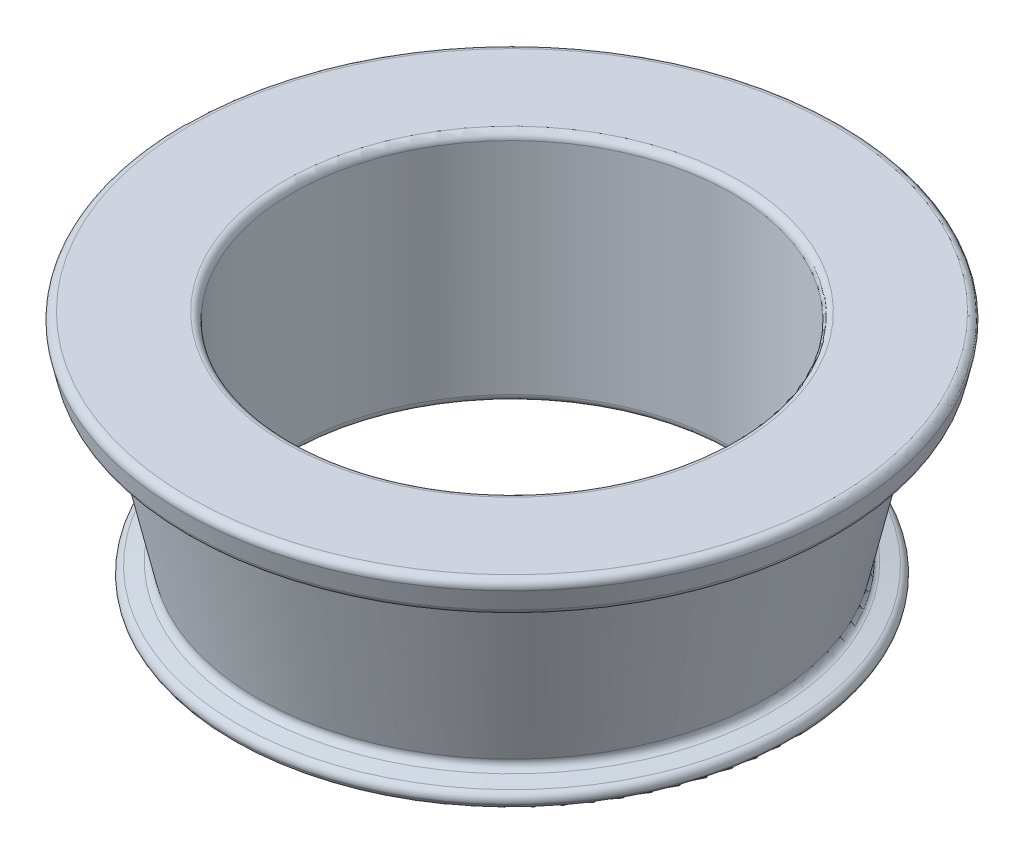
ISO-10303-21;
HEADER;
FILE_DESCRIPTION(('STEP AP214'),'2;1');
FILE_NAME('part.step','',(''),(''),'','','');
FILE_SCHEMA(('AUTOMOTIVE_DESIGN { 1 0 10303 214 1 1 1 1 }'));
ENDSEC;
DATA;
#1=APPLICATION_CONTEXT('core data for automotive mechanical design processes');
#2=APPLICATION_PROTOCOL_DEFINITION('international standard','automotive_design',2000,#1);
#3=PRODUCT_CONTEXT('',#1,'mechanical');
#4=PRODUCT('Part','Part','',(#3));
#5=PRODUCT_RELATED_PRODUCT_CATEGORY('part','',(#4));
#6=PRODUCT_DEFINITION_FORMATION('','',#4);
#7=PRODUCT_DEFINITION_CONTEXT('part definition',#1,'design');
#8=PRODUCT_DEFINITION('design','',#6,#7);
#9=PRODUCT_DEFINITION_SHAPE('','',#8);
#10=(LENGTH_UNIT() NAMED_UNIT(*) SI_UNIT(.MILLI.,.METRE.));
#11=(NAMED_UNIT(*) PLANE_ANGLE_UNIT() SI_UNIT($,.RADIAN.));
#12=(NAMED_UNIT(*) SI_UNIT($,.STERADIAN.) SOLID_ANGLE_UNIT());
#13=UNCERTAINTY_MEASURE_WITH_UNIT(LENGTH_MEASURE(1.E-05),#10,'distance_accuracy_value','');
#14=(GEOMETRIC_REPRESENTATION_CONTEXT(3) GLOBAL_UNCERTAINTY_ASSIGNED_CONTEXT((#13)) GLOBAL_UNIT_ASSIGNED_CONTEXT((#10,
#11,#12)) REPRESENTATION_CONTEXT('',''));
#15=CARTESIAN_POINT('',(0.,0.,0.));
#16=DIRECTION('',(0.,0.,1.));
#17=DIRECTION('',(1.,0.,0.));
#18=AXIS2_PLACEMENT_3D('',#15,#16,#17);
#19=CARTESIAN_POINT('',(0.,0.900000000000007,0.));
#20=DIRECTION('',(0.,1.,0.));
#21=DIRECTION('',(0.,0.,1.));
#22=AXIS2_PLACEMENT_3D('',#19,#20,#21);
#23=CONICAL_SURFACE('',#22,19.248483998542,0.269382388297483);
#24=CARTESIAN_POINT('',(0.,0.366931925164515,0.));
#25=DIRECTION('',(0.,-1.,0.));
#26=DIRECTION('',(0.,0.,-1.));
#27=AXIS2_PLACEMENT_3D('',#24,#25,#26);
#28=CIRCLE('',#27,19.1013074577307);
#29=CARTESIAN_POINT('',(0.,0.366931925164515,-19.1013074577307));
#30=VERTEX_POINT('',#29);
#31=EDGE_CURVE('E85',#30,#30,#28,.F.);
#32=ORIENTED_EDGE('',*,*,#31,.T.);
#33=EDGE_LOOP('',(#32));
#34=FACE_BOUND('',#33,.T.);
#35=CARTESIAN_POINT('',(0.,0.394463191682515,0.));
#36=DIRECTION('',(0.,-1.,0.));
#37=DIRECTION('',(0.,0.,-1.));
#38=AXIS2_PLACEMENT_3D('',#35,#36,#37);
#39=CIRCLE('',#38,19.1089086568299);
#40=CARTESIAN_POINT('',(0.,0.394463191682515,-19.1089086568299));
#41=VERTEX_POINT('',#40);
#42=EDGE_CURVE('E89',#41,#41,#39,.T.);
#43=ORIENTED_EDGE('',*,*,#42,.T.);
#44=EDGE_LOOP('',(#43));
#45=FACE_BOUND('',#44,.T.);
#46=ADVANCED_FACE('F41',(#34,#45),#23,.T.);
#47=CARTESIAN_POINT('',(-19.,0.,0.));
#48=DIRECTION('',(0.,1.,0.));
#49=DIRECTION('',(0.,0.,1.));
#50=AXIS2_PLACEMENT_3D('',#47,#48,#49);
#51=PLANE('',#50);
#52=CARTESIAN_POINT('',(0.,0.,0.));
#53=DIRECTION('',(0.,1.,0.));
#54=DIRECTION('',(0.,0.,1.));
#55=AXIS2_PLACEMENT_3D('',#52,#53,#54);
#56=CIRCLE('',#55,18.6193397332308);
#57=CARTESIAN_POINT('',(0.,0.,18.6193397332308));
#58=VERTEX_POINT('',#57);
#59=EDGE_CURVE('E93',#58,#58,#56,.F.);
#60=ORIENTED_EDGE('',*,*,#59,.T.);
#61=EDGE_LOOP('',(#60));
#62=FACE_BOUND('',#61,.T.);
#63=CARTESIAN_POINT('',(0.,0.,0.));
#64=DIRECTION('',(0.,1.,0.));
#65=DIRECTION('',(0.,0.,1.));
#66=AXIS2_PLACEMENT_3D('',#63,#64,#65);
#67=CIRCLE('',#66,15.5);
#68=CARTESIAN_POINT('',(0.,0.,15.5));
#69=VERTEX_POINT('',#68);
#70=EDGE_CURVE('E101',#69,#69,#67,.T.);
#71=ORIENTED_EDGE('',*,*,#70,.T.);
#72=EDGE_LOOP('',(#71));
#73=FACE_BOUND('',#72,.T.);
#74=ADVANCED_FACE('F136',(#62,#73),#51,.F.);
#75=CARTESIAN_POINT('',(0.,0.,0.));
#76=DIRECTION('',(0.,-1.,0.));
#77=DIRECTION('',(0.,0.,-1.));
#78=AXIS2_PLACEMENT_3D('',#75,#76,#77);
#79=CYLINDRICAL_SURFACE('',#78,15.);
#80=CARTESIAN_POINT('',(0.,0.499999999999998,0.));
#81=DIRECTION('',(0.,1.,0.));
#82=DIRECTION('',(0.,0.,1.));
#83=AXIS2_PLACEMENT_3D('',#80,#81,#82);
#84=CIRCLE('',#83,15.);
#85=CARTESIAN_POINT('',(0.,0.499999999999998,15.));
#86=VERTEX_POINT('',#85);
#87=EDGE_CURVE('E105',#86,#86,#84,.F.);
#88=ORIENTED_EDGE('',*,*,#87,.T.);
#89=EDGE_LOOP('',(#88));
#90=FACE_BOUND('',#89,.T.);
#91=CARTESIAN_POINT('',(0.,15.5,0.));
#92=DIRECTION('',(0.,-1.,0.));
#93=DIRECTION('',(0.,0.,-1.));
#94=AXIS2_PLACEMENT_3D('',#91,#92,#93);
#95=CIRCLE('',#94,15.);
#96=CARTESIAN_POINT('',(0.,15.5,-15.));
#97=VERTEX_POINT('',#96);
#98=EDGE_CURVE('E109',#97,#97,#95,.F.);
#99=ORIENTED_EDGE('',*,*,#98,.T.);
#100=EDGE_LOOP('',(#99));
#101=FACE_BOUND('',#100,.T.);
#102=ADVANCED_FACE('F114',(#90,#101),#79,.F.);
#103=CARTESIAN_POINT('',(-15.,16.,0.));
#104=DIRECTION('',(0.,-1.,0.));
#105=DIRECTION('',(0.,0.,-1.));
#106=AXIS2_PLACEMENT_3D('',#103,#104,#105);
#107=PLANE('',#106);
#108=CARTESIAN_POINT('',(0.,16.,0.));
#109=DIRECTION('',(0.,-1.,0.));
#110=DIRECTION('',(0.,0.,-1.));
#111=AXIS2_PLACEMENT_3D('',#108,#109,#110);
#112=CIRCLE('',#111,21.974780620572);
#113=CARTESIAN_POINT('',(0.,16.,-21.974780620572));
#114=VERTEX_POINT('',#113);
#115=EDGE_CURVE('E73',#114,#114,#112,.F.);
#116=ORIENTED_EDGE('',*,*,#115,.T.);
#117=EDGE_LOOP('',(#116));
#118=FACE_BOUND('',#117,.T.);
#119=CARTESIAN_POINT('',(0.,16.,0.));
#120=DIRECTION('',(0.,-1.,0.));
#121=DIRECTION('',(0.,0.,-1.));
#122=AXIS2_PLACEMENT_3D('',#119,#120,#121);
#123=CIRCLE('',#122,15.5);
#124=CARTESIAN_POINT('',(0.,16.,-15.5));
#125=VERTEX_POINT('',#124);
#126=EDGE_CURVE('E97',#125,#125,#123,.T.);
#127=ORIENTED_EDGE('',*,*,#126,.T.);
#128=EDGE_LOOP('',(#127));
#129=FACE_BOUND('',#128,.T.);
#130=ADVANCED_FACE('F124',(#118,#129),#107,.F.);
#131=CARTESIAN_POINT('',(0.,16.,0.));
#132=DIRECTION('',(0.,1.,0.));
#133=DIRECTION('',(0.,0.,1.));
#134=AXIS2_PLACEMENT_3D('',#131,#132,#133);
#135=CONICAL_SURFACE('',#134,22.6,0.221656815003283);
#136=CARTESIAN_POINT('',(0.,15.3900768978236,0.));
#137=DIRECTION('',(0.,-1.,0.));
#138=DIRECTION('',(0.,0.,-1.));
#139=AXIS2_PLACEMENT_3D('',#136,#137,#138);
#140=CIRCLE('',#139,22.4625478925449);
#141=CARTESIAN_POINT('',(0.,15.3900768978236,-22.4625478925449));
#142=VERTEX_POINT('',#141);
#143=EDGE_CURVE('E77',#142,#142,#140,.T.);
#144=ORIENTED_EDGE('',*,*,#143,.T.);
#145=EDGE_LOOP('',(#144));
#146=FACE_BOUND('',#145,.T.);
#147=CARTESIAN_POINT('',(0.,14.0489309121083,0.));
#148=DIRECTION('',(0.,-1.,0.));
#149=DIRECTION('',(0.,0.,-1.));
#150=AXIS2_PLACEMENT_3D('',#147,#148,#149);
#151=CIRCLE('',#150,22.1603075912943);
#152=CARTESIAN_POINT('',(0.,14.0489309121083,-22.1603075912943));
#153=VERTEX_POINT('',#152);
#154=EDGE_CURVE('E81',#153,#153,#151,.F.);
#155=ORIENTED_EDGE('',*,*,#154,.T.);
#156=EDGE_LOOP('',(#155));
#157=FACE_BOUND('',#156,.T.);
#158=ADVANCED_FACE('F126',(#146,#157),#135,.T.);
#159=CARTESIAN_POINT('',(0.,13.5611636401354,0.));
#160=DIRECTION('',(0.,-1.,0.));
#161=DIRECTION('',(0.,0.,-1.));
#162=AXIS2_PLACEMENT_3D('',#159,#160,#161);
#163=CONICAL_SURFACE('',#162,22.0503844891179,1.34913951179161);
#164=CARTESIAN_POINT('',(0.,13.8909329466646,0.));
#165=DIRECTION('',(0.,-1.,0.));
#166=DIRECTION('',(0.,0.,-1.));
#167=AXIS2_PLACEMENT_3D('',#164,#165,#166);
#168=CIRCLE('',#167,20.5870826731991);
#169=CARTESIAN_POINT('',(0.,13.8909329466646,-20.5870826731991));
#170=VERTEX_POINT('',#169);
#171=EDGE_CURVE('E10',#170,#170,#168,.F.);
#172=ORIENTED_EDGE('',*,*,#171,.T.);
#173=EDGE_LOOP('',(#172));
#174=FACE_BOUND('',#173,.T.);
#175=CARTESIAN_POINT('',(0.,13.6710867423118,0.));
#176=DIRECTION('',(0.,1.,0.));
#177=DIRECTION('',(0.,0.,1.));
#178=AXIS2_PLACEMENT_3D('',#175,#176,#177);
#179=CIRCLE('',#178,21.562617217145);
#180=CARTESIAN_POINT('',(0.,13.6710867423118,21.562617217145));
#181=VERTEX_POINT('',#180);
#182=EDGE_CURVE('E49',#181,#181,#179,.F.);
#183=ORIENTED_EDGE('',*,*,#182,.T.);
#184=EDGE_LOOP('',(#183));
#185=FACE_BOUND('',#184,.T.);
#186=ADVANCED_FACE('F133',(#174,#185),#163,.F.);
#187=CARTESIAN_POINT('',(0.,14.000856048841,0.));
#188=DIRECTION('',(0.,1.,0.));
#189=DIRECTION('',(0.,0.,1.));
#190=AXIS2_PLACEMENT_3D('',#187,#188,#189);
#191=CONICAL_SURFACE('',#190,20.0993154012262,0.221656815003284);
#192=CARTESIAN_POINT('',(0.,1.83848673796663,0.));
#193=DIRECTION('',(0.,1.,0.));
#194=DIRECTION('',(0.,0.,1.));
#195=AXIS2_PLACEMENT_3D('',#192,#193,#194);
#196=CIRCLE('',#195,17.3584071007184);
#197=CARTESIAN_POINT('',(0.,1.83848673796663,17.3584071007184));
#198=VERTEX_POINT('',#197);
#199=EDGE_CURVE('E54',#198,#198,#196,.T.);
#200=ORIENTED_EDGE('',*,*,#199,.T.);
#201=EDGE_LOOP('',(#200));
#202=FACE_BOUND('',#201,.T.);
#203=CARTESIAN_POINT('',(0.,13.5130887768681,0.));
#204=DIRECTION('',(0.,1.,0.));
#205=DIRECTION('',(0.,0.,1.));
#206=AXIS2_PLACEMENT_3D('',#203,#204,#205);
#207=CIRCLE('',#206,19.9893922990498);
#208=CARTESIAN_POINT('',(0.,13.5130887768681,19.9893922990498));
#209=VERTEX_POINT('',#208);
#210=EDGE_CURVE('E59',#209,#209,#207,.F.);
#211=ORIENTED_EDGE('',*,*,#210,.T.);
#212=EDGE_LOOP('',(#211));
#213=FACE_BOUND('',#212,.T.);
#214=ADVANCED_FACE('F177',(#202,#213),#191,.T.);
#215=CARTESIAN_POINT('',(0.,1.3507194659937,0.));
#216=DIRECTION('',(0.,-1.,0.));
#217=DIRECTION('',(0.,0.,-1.));
#218=AXIS2_PLACEMENT_3D('',#215,#216,#217);
#219=CONICAL_SURFACE('',#218,17.248483998542,1.34913951179162);
#220=CARTESIAN_POINT('',(0.,1.01529853849092,0.));
#221=DIRECTION('',(0.,1.,0.));
#222=DIRECTION('',(0.,0.,1.));
#223=AXIS2_PLACEMENT_3D('',#220,#221,#222);
#224=CIRCLE('',#223,18.7368640345065);
#225=CARTESIAN_POINT('',(0.,1.01529853849092,18.7368640345065));
#226=VERTEX_POINT('',#225);
#227=EDGE_CURVE('E65',#226,#226,#224,.T.);
#228=ORIENTED_EDGE('',*,*,#227,.T.);
#229=EDGE_LOOP('',(#228));
#230=FACE_BOUND('',#229,.T.);
#231=CARTESIAN_POINT('',(0.,1.24079636381728,0.));
#232=DIRECTION('',(0.,-1.,0.));
#233=DIRECTION('',(0.,0.,-1.));
#234=AXIS2_PLACEMENT_3D('',#231,#232,#233);
#235=CIRCLE('',#234,17.736251270515);
#236=CARTESIAN_POINT('',(0.,1.24079636381728,-17.736251270515));
#237=VERTEX_POINT('',#236);
#238=EDGE_CURVE('E69',#237,#237,#235,.T.);
#239=ORIENTED_EDGE('',*,*,#238,.T.);
#240=EDGE_LOOP('',(#239));
#241=FACE_BOUND('',#240,.T.);
#242=ADVANCED_FACE('F150',(#230,#241),#219,.T.);
#243=CARTESIAN_POINT('',(0.,0.499999999999998,0.));
#244=DIRECTION('',(0.,1.,0.));
#245=DIRECTION('',(0.,0.,1.));
#246=AXIS2_PLACEMENT_3D('',#243,#244,#245);
#247=TOROIDAL_SURFACE('',#246,15.5,0.5);
#248=ORIENTED_EDGE('',*,*,#70,.F.);
#249=EDGE_LOOP('',(#248));
#250=FACE_BOUND('',#249,.T.);
#251=ORIENTED_EDGE('',*,*,#87,.F.);
#252=EDGE_LOOP('',(#251));
#253=FACE_BOUND('',#252,.T.);
#254=ADVANCED_FACE('F120',(#250,#253),#247,.T.);
#255=CARTESIAN_POINT('',(0.,15.5,0.));
#256=DIRECTION('',(0.,-1.,0.));
#257=DIRECTION('',(0.,0.,-1.));
#258=AXIS2_PLACEMENT_3D('',#255,#256,#257);
#259=TOROIDAL_SURFACE('',#258,15.5,0.5);
#260=ORIENTED_EDGE('',*,*,#98,.F.);
#261=EDGE_LOOP('',(#260));
#262=FACE_BOUND('',#261,.T.);
#263=ORIENTED_EDGE('',*,*,#126,.F.);
#264=EDGE_LOOP('',(#263));
#265=FACE_BOUND('',#264,.T.);
#266=ADVANCED_FACE('F116',(#262,#265),#259,.T.);
#267=CARTESIAN_POINT('',(0.,0.499999999999998,0.));
#268=DIRECTION('',(0.,1.,0.));
#269=DIRECTION('',(0.,0.,1.));
#270=AXIS2_PLACEMENT_3D('',#267,#268,#269);
#271=TOROIDAL_SURFACE('',#270,18.6193397332308,0.5);
#272=ORIENTED_EDGE('',*,*,#31,.F.);
#273=EDGE_LOOP('',(#272));
#274=FACE_BOUND('',#273,.T.);
#275=ORIENTED_EDGE('',*,*,#59,.F.);
#276=EDGE_LOOP('',(#275));
#277=FACE_BOUND('',#276,.T.);
#278=ADVANCED_FACE('F119',(#274,#277),#271,.T.);
#279=CARTESIAN_POINT('',(0.,15.5,0.));
#280=DIRECTION('',(0.,-1.,0.));
#281=DIRECTION('',(0.,0.,-1.));
#282=AXIS2_PLACEMENT_3D('',#279,#280,#281);
#283=TOROIDAL_SURFACE('',#282,21.974780620572,0.5);
#284=ORIENTED_EDGE('',*,*,#115,.F.);
#285=EDGE_LOOP('',(#284));
#286=FACE_BOUND('',#285,.T.);
#287=ORIENTED_EDGE('',*,*,#143,.F.);
#288=EDGE_LOOP('',(#287));
#289=FACE_BOUND('',#288,.T.);
#290=ADVANCED_FACE('F155',(#286,#289),#283,.T.);
#291=CARTESIAN_POINT('',(0.,0.527531266517989,0.));
#292=DIRECTION('',(0.,1.,0.));
#293=DIRECTION('',(0.,0.,1.));
#294=AXIS2_PLACEMENT_3D('',#291,#292,#293);
#295=TOROIDAL_SURFACE('',#294,18.62694093233,0.5);
#296=ORIENTED_EDGE('',*,*,#227,.F.);
#297=EDGE_LOOP('',(#296));
#298=FACE_BOUND('',#297,.T.);
#299=ORIENTED_EDGE('',*,*,#42,.F.);
#300=EDGE_LOOP('',(#299));
#301=FACE_BOUND('',#300,.T.);
#302=ADVANCED_FACE('F159',(#298,#301),#295,.T.);
#303=CARTESIAN_POINT('',(0.,1.72856363579021,0.));
#304=DIRECTION('',(0.,-1.,0.));
#305=DIRECTION('',(0.,0.,-1.));
#306=AXIS2_PLACEMENT_3D('',#303,#304,#305);
#307=TOROIDAL_SURFACE('',#306,17.8461743726914,0.5);
#308=ORIENTED_EDGE('',*,*,#199,.F.);
#309=EDGE_LOOP('',(#308));
#310=FACE_BOUND('',#309,.T.);
#311=ORIENTED_EDGE('',*,*,#238,.F.);
#312=EDGE_LOOP('',(#311));
#313=FACE_BOUND('',#312,.T.);
#314=ADVANCED_FACE('F163',(#310,#313),#307,.F.);
#315=CARTESIAN_POINT('',(0.,13.4031656746917,0.));
#316=DIRECTION('',(0.,-1.,0.));
#317=DIRECTION('',(0.,0.,-1.));
#318=AXIS2_PLACEMENT_3D('',#315,#316,#317);
#319=TOROIDAL_SURFACE('',#318,20.4771595710227,0.5);
#320=ORIENTED_EDGE('',*,*,#171,.F.);
#321=EDGE_LOOP('',(#320));
#322=FACE_BOUND('',#321,.T.);
#323=ORIENTED_EDGE('',*,*,#210,.F.);
#324=EDGE_LOOP('',(#323));
#325=FACE_BOUND('',#324,.T.);
#326=ADVANCED_FACE('F166',(#322,#325),#319,.F.);
#327=CARTESIAN_POINT('',(0.,14.1588540142847,0.));
#328=DIRECTION('',(0.,1.,0.));
#329=DIRECTION('',(0.,0.,1.));
#330=AXIS2_PLACEMENT_3D('',#327,#328,#329);
#331=TOROIDAL_SURFACE('',#330,21.6725403193214,0.5);
#332=ORIENTED_EDGE('',*,*,#154,.F.);
#333=EDGE_LOOP('',(#332));
#334=FACE_BOUND('',#333,.T.);
#335=ORIENTED_EDGE('',*,*,#182,.F.);
#336=EDGE_LOOP('',(#335));
#337=FACE_BOUND('',#336,.T.);
#338=ADVANCED_FACE('F43',(#334,#337),#331,.T.);
#339=CLOSED_SHELL('',(#46,#74,#102,#130,#158,#186,#214,#242,#254,#266,#278,#290,#302,#314,#326,#338));
#340=MANIFOLD_SOLID_BREP('B2',#339);
#341=ADVANCED_BREP_SHAPE_REPRESENTATION('',(#18,#340),#14);
#342=SHAPE_DEFINITION_REPRESENTATION(#9,#341);
ENDSEC;
END-ISO-10303-21;
